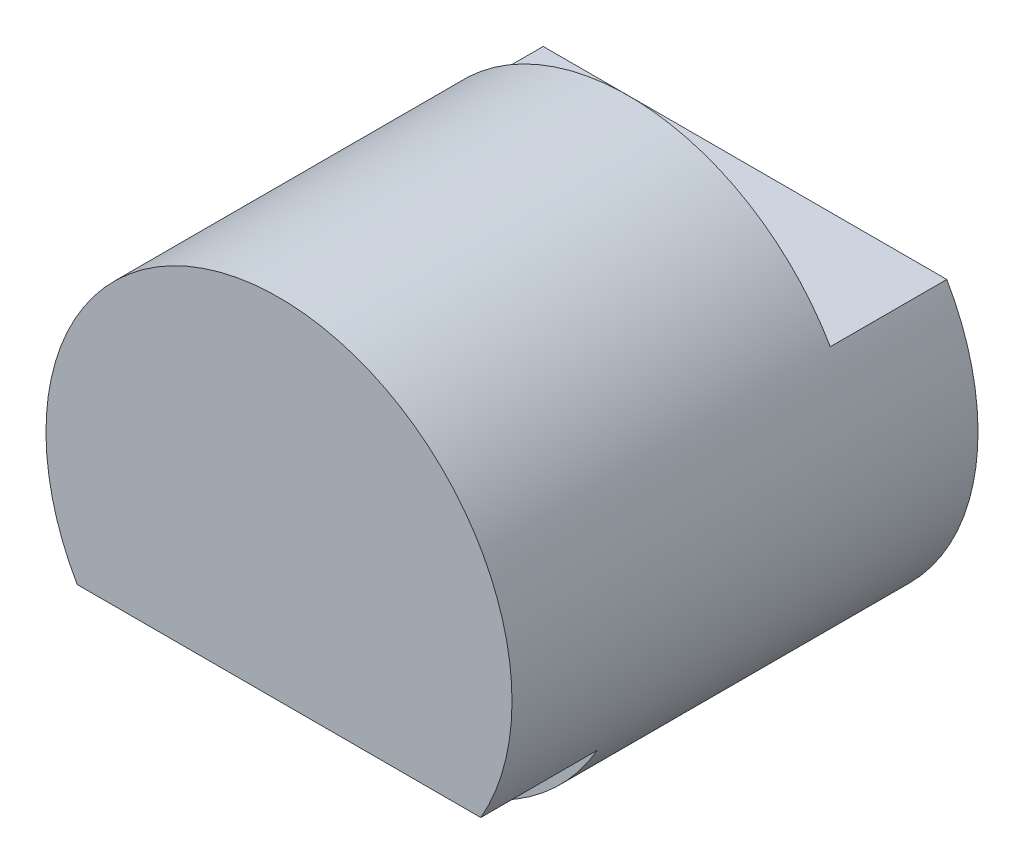
ISO-10303-21;
HEADER;
FILE_DESCRIPTION(('STEP AP214'),'2;1');
FILE_NAME('part.step','',(''),(''),'','','');
FILE_SCHEMA(('AUTOMOTIVE_DESIGN { 1 0 10303 214 1 1 1 1 }'));
ENDSEC;
DATA;
#1=APPLICATION_CONTEXT('core data for automotive mechanical design processes');
#2=APPLICATION_PROTOCOL_DEFINITION('international standard','automotive_design',2000,#1);
#3=PRODUCT_CONTEXT('',#1,'mechanical');
#4=PRODUCT('Part','Part','',(#3));
#5=PRODUCT_RELATED_PRODUCT_CATEGORY('part','',(#4));
#6=PRODUCT_DEFINITION_FORMATION('','',#4);
#7=PRODUCT_DEFINITION_CONTEXT('part definition',#1,'design');
#8=PRODUCT_DEFINITION('design','',#6,#7);
#9=PRODUCT_DEFINITION_SHAPE('','',#8);
#10=(LENGTH_UNIT() NAMED_UNIT(*) SI_UNIT(.MILLI.,.METRE.));
#11=(NAMED_UNIT(*) PLANE_ANGLE_UNIT() SI_UNIT($,.RADIAN.));
#12=(NAMED_UNIT(*) SI_UNIT($,.STERADIAN.) SOLID_ANGLE_UNIT());
#13=UNCERTAINTY_MEASURE_WITH_UNIT(LENGTH_MEASURE(1.E-05),#10,'distance_accuracy_value','');
#14=(GEOMETRIC_REPRESENTATION_CONTEXT(3) GLOBAL_UNCERTAINTY_ASSIGNED_CONTEXT((#13)) GLOBAL_UNIT_ASSIGNED_CONTEXT((#10,
#11,#12)) REPRESENTATION_CONTEXT('',''));
#15=CARTESIAN_POINT('',(0.,0.,0.));
#16=DIRECTION('',(0.,0.,1.));
#17=DIRECTION('',(1.,0.,0.));
#18=AXIS2_PLACEMENT_3D('',#15,#16,#17);
#19=CARTESIAN_POINT('',(0.,0.,3.));
#20=DIRECTION('',(0.,0.,1.));
#21=DIRECTION('',(1.,0.,0.));
#22=AXIS2_PLACEMENT_3D('',#19,#20,#21);
#23=PLANE('',#22);
#24=CARTESIAN_POINT('',(0.,0.,3.));
#25=DIRECTION('',(0.,0.,1.));
#26=DIRECTION('',(1.,0.,0.));
#27=AXIS2_PLACEMENT_3D('',#24,#25,#26);
#28=CIRCLE('',#27,2.);
#29=CARTESIAN_POINT('',(-1.73205080756888,-1.,3.));
#30=VERTEX_POINT('',#29);
#31=CARTESIAN_POINT('',(1.73205080756888,-1.,3.));
#32=VERTEX_POINT('',#31);
#33=EDGE_CURVE('E11',#30,#32,#28,.T.);
#34=ORIENTED_EDGE('',*,*,#33,.T.);
#35=DIRECTION('',(1.,0.,0.));
#36=VECTOR('',#35,1.);
#37=CARTESIAN_POINT('',(-1.73205080756888,-1.,3.));
#38=LINE('',#37,#36);
#39=EDGE_CURVE('E82',#30,#32,#38,.T.);
#40=ORIENTED_EDGE('',*,*,#39,.F.);
#41=EDGE_LOOP('',(#34,#40));
#42=FACE_BOUND('',#41,.T.);
#43=ADVANCED_FACE('F33',(#42),#23,.T.);
#44=CARTESIAN_POINT('',(0.,0.,3.));
#45=DIRECTION('',(0.,0.,-1.));
#46=DIRECTION('',(-1.,0.,0.));
#47=AXIS2_PLACEMENT_3D('',#44,#45,#46);
#48=CYLINDRICAL_SURFACE('',#47,2.);
#49=ORIENTED_EDGE('',*,*,#33,.F.);
#50=DIRECTION('',(0.,0.,-1.));
#51=VECTOR('',#50,1.);
#52=CARTESIAN_POINT('',(-1.73205080756888,-1.,4.));
#53=LINE('',#52,#51);
#54=CARTESIAN_POINT('',(-1.73205080756888,-1.,4.));
#55=VERTEX_POINT('',#54);
#56=EDGE_CURVE('E86',#55,#30,#53,.T.);
#57=ORIENTED_EDGE('',*,*,#56,.F.);
#58=CARTESIAN_POINT('',(0.,0.,4.));
#59=DIRECTION('',(0.,0.,1.));
#60=DIRECTION('',(-1.,0.,0.));
#61=AXIS2_PLACEMENT_3D('',#58,#59,#60);
#62=CIRCLE('',#61,2.);
#63=CARTESIAN_POINT('',(1.73205080756888,-1.,4.));
#64=VERTEX_POINT('',#63);
#65=EDGE_CURVE('E71',#64,#55,#62,.T.);
#66=ORIENTED_EDGE('',*,*,#65,.F.);
#67=DIRECTION('',(0.,0.,-1.));
#68=VECTOR('',#67,1.);
#69=CARTESIAN_POINT('',(1.73205080756888,-1.,4.));
#70=LINE('',#69,#68);
#71=EDGE_CURVE('E85',#64,#32,#70,.T.);
#72=ORIENTED_EDGE('',*,*,#71,.T.);
#73=EDGE_LOOP('',(#49,#57,#66,#72));
#74=FACE_BOUND('',#73,.T.);
#75=CARTESIAN_POINT('',(0.,0.,1.));
#76=DIRECTION('',(0.,0.,-1.));
#77=DIRECTION('',(-1.,0.,0.));
#78=AXIS2_PLACEMENT_3D('',#75,#76,#77);
#79=CIRCLE('',#78,2.);
#80=CARTESIAN_POINT('',(-1.73205080756888,1.,1.));
#81=VERTEX_POINT('',#80);
#82=CARTESIAN_POINT('',(1.73205080756888,1.,1.));
#83=VERTEX_POINT('',#82);
#84=EDGE_CURVE('E122',#81,#83,#79,.T.);
#85=ORIENTED_EDGE('',*,*,#84,.F.);
#86=DIRECTION('',(0.,0.,-1.));
#87=VECTOR('',#86,1.);
#88=CARTESIAN_POINT('',(-1.73205080756888,1.,1.));
#89=LINE('',#88,#87);
#90=CARTESIAN_POINT('',(-1.73205080756888,1.,0.));
#91=VERTEX_POINT('',#90);
#92=EDGE_CURVE('E56',#81,#91,#89,.T.);
#93=ORIENTED_EDGE('',*,*,#92,.T.);
#94=CARTESIAN_POINT('',(0.,0.,0.));
#95=DIRECTION('',(0.,0.,1.));
#96=DIRECTION('',(1.,0.,0.));
#97=AXIS2_PLACEMENT_3D('',#94,#95,#96);
#98=CIRCLE('',#97,2.);
#99=CARTESIAN_POINT('',(1.73205080756888,1.,0.));
#100=VERTEX_POINT('',#99);
#101=EDGE_CURVE('E42',#91,#100,#98,.T.);
#102=ORIENTED_EDGE('',*,*,#101,.T.);
#103=DIRECTION('',(0.,0.,-1.));
#104=VECTOR('',#103,1.);
#105=CARTESIAN_POINT('',(1.73205080756888,1.,1.));
#106=LINE('',#105,#104);
#107=EDGE_CURVE('E50',#83,#100,#106,.T.);
#108=ORIENTED_EDGE('',*,*,#107,.F.);
#109=EDGE_LOOP('',(#85,#93,#102,#108));
#110=FACE_BOUND('',#109,.T.);
#111=ADVANCED_FACE('F35',(#74,#110),#48,.T.);
#112=CARTESIAN_POINT('',(0.,0.,0.));
#113=DIRECTION('',(0.,0.,1.));
#114=DIRECTION('',(1.,0.,0.));
#115=AXIS2_PLACEMENT_3D('',#112,#113,#114);
#116=PLANE('',#115);
#117=ORIENTED_EDGE('',*,*,#101,.F.);
#118=DIRECTION('',(-1.,0.,0.));
#119=VECTOR('',#118,1.);
#120=CARTESIAN_POINT('',(-1.73205080756888,1.,0.));
#121=LINE('',#120,#119);
#122=EDGE_CURVE('E63',#100,#91,#121,.T.);
#123=ORIENTED_EDGE('',*,*,#122,.F.);
#124=EDGE_LOOP('',(#117,#123));
#125=FACE_BOUND('',#124,.T.);
#126=ADVANCED_FACE('F99',(#125),#116,.F.);
#127=CARTESIAN_POINT('',(0.,0.,4.));
#128=DIRECTION('',(0.,0.,-1.));
#129=DIRECTION('',(-1.,0.,0.));
#130=AXIS2_PLACEMENT_3D('',#127,#128,#129);
#131=PLANE('',#130);
#132=ORIENTED_EDGE('',*,*,#65,.T.);
#133=DIRECTION('',(1.,0.,0.));
#134=VECTOR('',#133,1.);
#135=CARTESIAN_POINT('',(-1.73205080756888,-1.,4.));
#136=LINE('',#135,#134);
#137=EDGE_CURVE('E89',#55,#64,#136,.T.);
#138=ORIENTED_EDGE('',*,*,#137,.T.);
#139=EDGE_LOOP('',(#132,#138));
#140=FACE_BOUND('',#139,.T.);
#141=ADVANCED_FACE('F101',(#140),#131,.F.);
#142=CARTESIAN_POINT('',(-1.73205080756888,1.,1.));
#143=DIRECTION('',(0.,-1.,0.));
#144=DIRECTION('',(1.,0.,0.));
#145=AXIS2_PLACEMENT_3D('',#142,#143,#144);
#146=PLANE('',#145);
#147=ORIENTED_EDGE('',*,*,#122,.T.);
#148=ORIENTED_EDGE('',*,*,#92,.F.);
#149=DIRECTION('',(-1.,0.,0.));
#150=VECTOR('',#149,1.);
#151=CARTESIAN_POINT('',(-1.73205080756888,1.,1.));
#152=LINE('',#151,#150);
#153=EDGE_CURVE('E124',#83,#81,#152,.T.);
#154=ORIENTED_EDGE('',*,*,#153,.F.);
#155=ORIENTED_EDGE('',*,*,#107,.T.);
#156=EDGE_LOOP('',(#147,#148,#154,#155));
#157=FACE_BOUND('',#156,.T.);
#158=ADVANCED_FACE('F109',(#157),#146,.F.);
#159=CARTESIAN_POINT('',(0.,0.,1.));
#160=DIRECTION('',(0.,0.,-1.));
#161=DIRECTION('',(-1.,0.,0.));
#162=AXIS2_PLACEMENT_3D('',#159,#160,#161);
#163=PLANE('',#162);
#164=ORIENTED_EDGE('',*,*,#84,.T.);
#165=ORIENTED_EDGE('',*,*,#153,.T.);
#166=EDGE_LOOP('',(#164,#165));
#167=FACE_BOUND('',#166,.T.);
#168=ADVANCED_FACE('F131',(#167),#163,.T.);
#169=CARTESIAN_POINT('',(-1.73205080756888,-1.,4.));
#170=DIRECTION('',(0.,1.,0.));
#171=DIRECTION('',(0.,0.,1.));
#172=AXIS2_PLACEMENT_3D('',#169,#170,#171);
#173=PLANE('',#172);
#174=ORIENTED_EDGE('',*,*,#39,.T.);
#175=ORIENTED_EDGE('',*,*,#71,.F.);
#176=ORIENTED_EDGE('',*,*,#137,.F.);
#177=ORIENTED_EDGE('',*,*,#56,.T.);
#178=EDGE_LOOP('',(#174,#175,#176,#177));
#179=FACE_BOUND('',#178,.T.);
#180=ADVANCED_FACE('F83',(#179),#173,.F.);
#181=CLOSED_SHELL('',(#43,#111,#126,#141,#158,#168,#180));
#182=MANIFOLD_SOLID_BREP('B2',#181);
#183=ADVANCED_BREP_SHAPE_REPRESENTATION('',(#18,#182),#14);
#184=SHAPE_DEFINITION_REPRESENTATION(#9,#183);
ENDSEC;
END-ISO-10303-21;
